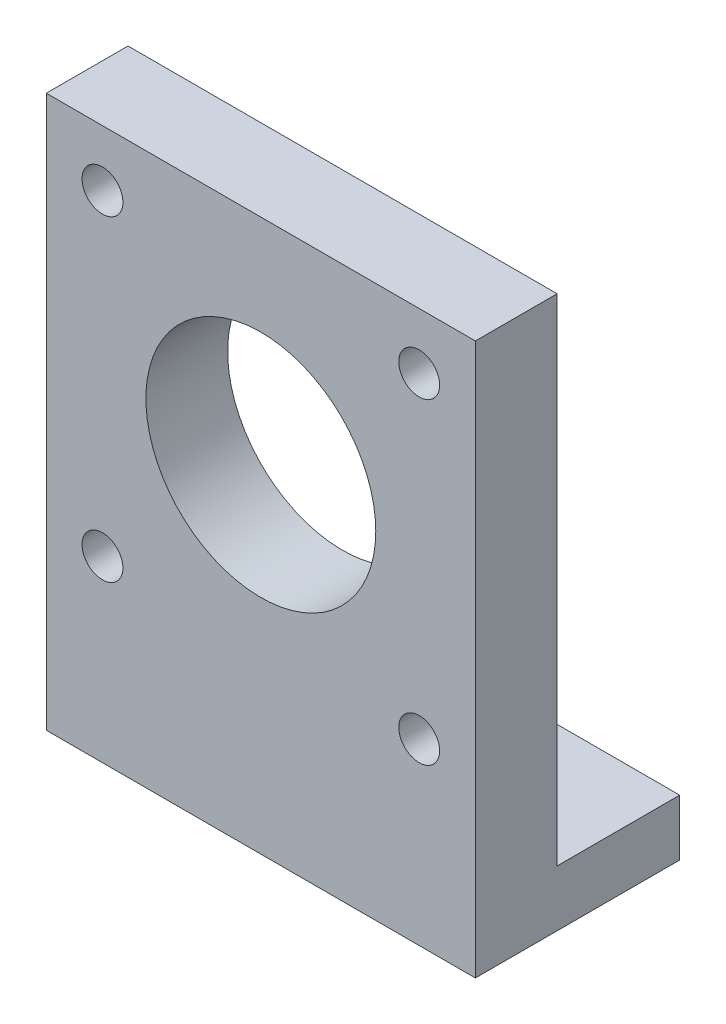
ISO-10303-21;
HEADER;
FILE_DESCRIPTION(('STEP AP214'),'2;1');
FILE_NAME('part.step','',(''),(''),'','','');
FILE_SCHEMA(('AUTOMOTIVE_DESIGN { 1 0 10303 214 1 1 1 1 }'));
ENDSEC;
DATA;
#1=APPLICATION_CONTEXT('core data for automotive mechanical design processes');
#2=APPLICATION_PROTOCOL_DEFINITION('international standard','automotive_design',2000,#1);
#3=PRODUCT_CONTEXT('',#1,'mechanical');
#4=PRODUCT('Part','Part','',(#3));
#5=PRODUCT_RELATED_PRODUCT_CATEGORY('part','',(#4));
#6=PRODUCT_DEFINITION_FORMATION('','',#4);
#7=PRODUCT_DEFINITION_CONTEXT('part definition',#1,'design');
#8=PRODUCT_DEFINITION('design','',#6,#7);
#9=PRODUCT_DEFINITION_SHAPE('','',#8);
#10=(LENGTH_UNIT() NAMED_UNIT(*) SI_UNIT(.MILLI.,.METRE.));
#11=(NAMED_UNIT(*) PLANE_ANGLE_UNIT() SI_UNIT($,.RADIAN.));
#12=(NAMED_UNIT(*) SI_UNIT($,.STERADIAN.) SOLID_ANGLE_UNIT());
#13=UNCERTAINTY_MEASURE_WITH_UNIT(LENGTH_MEASURE(1.E-05),#10,'distance_accuracy_value','');
#14=(GEOMETRIC_REPRESENTATION_CONTEXT(3) GLOBAL_UNCERTAINTY_ASSIGNED_CONTEXT((#13)) GLOBAL_UNIT_ASSIGNED_CONTEXT((#10,
#11,#12)) REPRESENTATION_CONTEXT('',''));
#15=CARTESIAN_POINT('',(0.,0.,0.));
#16=DIRECTION('',(0.,0.,1.));
#17=DIRECTION('',(1.,0.,0.));
#18=AXIS2_PLACEMENT_3D('',#15,#16,#17);
#19=CARTESIAN_POINT('',(0.,0.,0.));
#20=DIRECTION('',(0.,0.,1.));
#21=DIRECTION('',(1.,0.,0.));
#22=AXIS2_PLACEMENT_3D('',#19,#20,#21);
#23=PLANE('',#22);
#24=CARTESIAN_POINT('',(0.,0.,0.));
#25=DIRECTION('',(0.,0.,1.));
#26=DIRECTION('',(1.,0.,0.));
#27=AXIS2_PLACEMENT_3D('',#24,#25,#26);
#28=CIRCLE('',#27,11.25);
#29=CARTESIAN_POINT('',(11.25,0.,0.));
#30=VERTEX_POINT('',#29);
#31=EDGE_CURVE('E125',#30,#30,#28,.T.);
#32=ORIENTED_EDGE('',*,*,#31,.T.);
#33=EDGE_LOOP('',(#32));
#34=FACE_BOUND('',#33,.T.);
#35=CARTESIAN_POINT('',(15.5,-15.5,0.));
#36=DIRECTION('',(0.,0.,1.));
#37=DIRECTION('',(1.,0.,0.));
#38=AXIS2_PLACEMENT_3D('',#35,#36,#37);
#39=CIRCLE('',#38,2.);
#40=CARTESIAN_POINT('',(17.5,-15.5,0.));
#41=VERTEX_POINT('',#40);
#42=EDGE_CURVE('E113',#41,#41,#39,.T.);
#43=ORIENTED_EDGE('',*,*,#42,.T.);
#44=EDGE_LOOP('',(#43));
#45=FACE_BOUND('',#44,.T.);
#46=CARTESIAN_POINT('',(-15.5,15.5,0.));
#47=DIRECTION('',(0.,0.,1.));
#48=DIRECTION('',(1.,0.,0.));
#49=AXIS2_PLACEMENT_3D('',#46,#47,#48);
#50=CIRCLE('',#49,2.);
#51=CARTESIAN_POINT('',(-13.5,15.5,0.));
#52=VERTEX_POINT('',#51);
#53=EDGE_CURVE('E100',#52,#52,#50,.T.);
#54=ORIENTED_EDGE('',*,*,#53,.T.);
#55=EDGE_LOOP('',(#54));
#56=FACE_BOUND('',#55,.T.);
#57=CARTESIAN_POINT('',(15.5,15.5,0.));
#58=DIRECTION('',(0.,0.,1.));
#59=DIRECTION('',(1.,0.,0.));
#60=AXIS2_PLACEMENT_3D('',#57,#58,#59);
#61=CIRCLE('',#60,2.);
#62=CARTESIAN_POINT('',(17.5,15.5,0.));
#63=VERTEX_POINT('',#62);
#64=EDGE_CURVE('E107',#63,#63,#61,.T.);
#65=ORIENTED_EDGE('',*,*,#64,.T.);
#66=EDGE_LOOP('',(#65));
#67=FACE_BOUND('',#66,.T.);
#68=CARTESIAN_POINT('',(-15.5,-15.5,0.));
#69=DIRECTION('',(0.,0.,1.));
#70=DIRECTION('',(1.,0.,0.));
#71=AXIS2_PLACEMENT_3D('',#68,#69,#70);
#72=CIRCLE('',#71,2.);
#73=CARTESIAN_POINT('',(-13.5,-15.5,0.));
#74=VERTEX_POINT('',#73);
#75=EDGE_CURVE('E119',#74,#74,#72,.T.);
#76=ORIENTED_EDGE('',*,*,#75,.T.);
#77=EDGE_LOOP('',(#76));
#78=FACE_BOUND('',#77,.T.);
#79=DIRECTION('',(1.,0.,0.));
#80=VECTOR('',#79,1.);
#81=CARTESIAN_POINT('',(21.,-27.5,0.));
#82=LINE('',#81,#80);
#83=CARTESIAN_POINT('',(-21.,-27.5,0.));
#84=VERTEX_POINT('',#83);
#85=CARTESIAN_POINT('',(21.,-27.5,0.));
#86=VERTEX_POINT('',#85);
#87=EDGE_CURVE('E50',#84,#86,#82,.T.);
#88=ORIENTED_EDGE('',*,*,#87,.F.);
#89=DIRECTION('',(0.,-1.,0.));
#90=VECTOR('',#89,1.);
#91=CARTESIAN_POINT('',(-21.,21.,0.));
#92=LINE('',#91,#90);
#93=CARTESIAN_POINT('',(-21.,21.,0.));
#94=VERTEX_POINT('',#93);
#95=EDGE_CURVE('E76',#94,#84,#92,.T.);
#96=ORIENTED_EDGE('',*,*,#95,.F.);
#97=DIRECTION('',(-1.,0.,0.));
#98=VECTOR('',#97,1.);
#99=CARTESIAN_POINT('',(-21.,21.,0.));
#100=LINE('',#99,#98);
#101=CARTESIAN_POINT('',(21.,21.,0.));
#102=VERTEX_POINT('',#101);
#103=EDGE_CURVE('E71',#102,#94,#100,.T.);
#104=ORIENTED_EDGE('',*,*,#103,.F.);
#105=DIRECTION('',(0.,1.,0.));
#106=VECTOR('',#105,1.);
#107=CARTESIAN_POINT('',(21.,21.,0.));
#108=LINE('',#107,#106);
#109=EDGE_CURVE('E77',#86,#102,#108,.T.);
#110=ORIENTED_EDGE('',*,*,#109,.F.);
#111=EDGE_LOOP('',(#88,#96,#104,#110));
#112=FACE_BOUND('',#111,.T.);
#113=ADVANCED_FACE('F33',(#34,#45,#56,#67,#78,#112),#23,.F.);
#114=CARTESIAN_POINT('',(0.,0.,8.));
#115=DIRECTION('',(0.,0.,1.));
#116=DIRECTION('',(1.,0.,0.));
#117=AXIS2_PLACEMENT_3D('',#114,#115,#116);
#118=PLANE('',#117);
#119=CARTESIAN_POINT('',(-15.5,-15.5,8.));
#120=DIRECTION('',(0.,0.,1.));
#121=DIRECTION('',(1.,0.,0.));
#122=AXIS2_PLACEMENT_3D('',#119,#120,#121);
#123=CIRCLE('',#122,2.);
#124=CARTESIAN_POINT('',(-13.5,-15.5,8.));
#125=VERTEX_POINT('',#124);
#126=EDGE_CURVE('E116',#125,#125,#123,.T.);
#127=ORIENTED_EDGE('',*,*,#126,.F.);
#128=EDGE_LOOP('',(#127));
#129=FACE_BOUND('',#128,.T.);
#130=CARTESIAN_POINT('',(15.5,15.5,8.));
#131=DIRECTION('',(0.,0.,1.));
#132=DIRECTION('',(1.,0.,0.));
#133=AXIS2_PLACEMENT_3D('',#130,#131,#132);
#134=CIRCLE('',#133,2.);
#135=CARTESIAN_POINT('',(17.5,15.5,8.));
#136=VERTEX_POINT('',#135);
#137=EDGE_CURVE('E104',#136,#136,#134,.T.);
#138=ORIENTED_EDGE('',*,*,#137,.F.);
#139=EDGE_LOOP('',(#138));
#140=FACE_BOUND('',#139,.T.);
#141=DIRECTION('',(0.,1.,0.));
#142=VECTOR('',#141,1.);
#143=CARTESIAN_POINT('',(21.,21.,8.));
#144=LINE('',#143,#142);
#145=CARTESIAN_POINT('',(21.,-33.,8.));
#146=VERTEX_POINT('',#145);
#147=CARTESIAN_POINT('',(21.,21.,8.));
#148=VERTEX_POINT('',#147);
#149=EDGE_CURVE('E86',#146,#148,#144,.T.);
#150=ORIENTED_EDGE('',*,*,#149,.T.);
#151=DIRECTION('',(-1.,0.,0.));
#152=VECTOR('',#151,1.);
#153=CARTESIAN_POINT('',(-21.,21.,8.));
#154=LINE('',#153,#152);
#155=CARTESIAN_POINT('',(-21.,21.,8.));
#156=VERTEX_POINT('',#155);
#157=EDGE_CURVE('E59',#148,#156,#154,.T.);
#158=ORIENTED_EDGE('',*,*,#157,.T.);
#159=DIRECTION('',(0.,-1.,0.));
#160=VECTOR('',#159,1.);
#161=CARTESIAN_POINT('',(-21.,21.,8.));
#162=LINE('',#161,#160);
#163=CARTESIAN_POINT('',(-21.,-33.,8.));
#164=VERTEX_POINT('',#163);
#165=EDGE_CURVE('E84',#156,#164,#162,.T.);
#166=ORIENTED_EDGE('',*,*,#165,.T.);
#167=DIRECTION('',(1.,0.,0.));
#168=VECTOR('',#167,1.);
#169=CARTESIAN_POINT('',(-21.,-33.,8.));
#170=LINE('',#169,#168);
#171=EDGE_CURVE('E133',#164,#146,#170,.T.);
#172=ORIENTED_EDGE('',*,*,#171,.T.);
#173=EDGE_LOOP('',(#150,#158,#166,#172));
#174=FACE_BOUND('',#173,.T.);
#175=CARTESIAN_POINT('',(-15.5,15.5,8.));
#176=DIRECTION('',(0.,0.,1.));
#177=DIRECTION('',(1.,0.,0.));
#178=AXIS2_PLACEMENT_3D('',#175,#176,#177);
#179=CIRCLE('',#178,2.);
#180=CARTESIAN_POINT('',(-13.5,15.5,8.));
#181=VERTEX_POINT('',#180);
#182=EDGE_CURVE('E103',#181,#181,#179,.T.);
#183=ORIENTED_EDGE('',*,*,#182,.F.);
#184=EDGE_LOOP('',(#183));
#185=FACE_BOUND('',#184,.T.);
#186=CARTESIAN_POINT('',(15.5,-15.5,8.));
#187=DIRECTION('',(0.,0.,1.));
#188=DIRECTION('',(1.,0.,0.));
#189=AXIS2_PLACEMENT_3D('',#186,#187,#188);
#190=CIRCLE('',#189,2.);
#191=CARTESIAN_POINT('',(17.5,-15.5,8.));
#192=VERTEX_POINT('',#191);
#193=EDGE_CURVE('E110',#192,#192,#190,.T.);
#194=ORIENTED_EDGE('',*,*,#193,.F.);
#195=EDGE_LOOP('',(#194));
#196=FACE_BOUND('',#195,.T.);
#197=CARTESIAN_POINT('',(0.,0.,8.));
#198=DIRECTION('',(0.,0.,1.));
#199=DIRECTION('',(1.,0.,0.));
#200=AXIS2_PLACEMENT_3D('',#197,#198,#199);
#201=CIRCLE('',#200,11.25);
#202=CARTESIAN_POINT('',(11.25,0.,8.));
#203=VERTEX_POINT('',#202);
#204=EDGE_CURVE('E122',#203,#203,#201,.T.);
#205=ORIENTED_EDGE('',*,*,#204,.F.);
#206=EDGE_LOOP('',(#205));
#207=FACE_BOUND('',#206,.T.);
#208=ADVANCED_FACE('F183',(#129,#140,#174,#185,#196,#207),#118,.T.);
#209=CARTESIAN_POINT('',(21.,21.,8.));
#210=DIRECTION('',(-1.,0.,0.));
#211=DIRECTION('',(0.,0.,1.));
#212=AXIS2_PLACEMENT_3D('',#209,#210,#211);
#213=PLANE('',#212);
#214=DIRECTION('',(0.,0.,1.));
#215=VECTOR('',#214,1.);
#216=CARTESIAN_POINT('',(21.,-33.,0.));
#217=LINE('',#216,#215);
#218=CARTESIAN_POINT('',(21.,-33.,-12.));
#219=VERTEX_POINT('',#218);
#220=EDGE_CURVE('E128',#219,#146,#217,.T.);
#221=ORIENTED_EDGE('',*,*,#220,.F.);
#222=DIRECTION('',(0.,-1.,0.));
#223=VECTOR('',#222,1.);
#224=CARTESIAN_POINT('',(21.,-27.5,-12.));
#225=LINE('',#224,#223);
#226=CARTESIAN_POINT('',(21.,-27.5,-12.));
#227=VERTEX_POINT('',#226);
#228=EDGE_CURVE('E144',#227,#219,#225,.T.);
#229=ORIENTED_EDGE('',*,*,#228,.F.);
#230=DIRECTION('',(0.,0.,1.));
#231=VECTOR('',#230,1.);
#232=CARTESIAN_POINT('',(21.,-27.5,-12.));
#233=LINE('',#232,#231);
#234=EDGE_CURVE('E143',#227,#86,#233,.T.);
#235=ORIENTED_EDGE('',*,*,#234,.T.);
#236=ORIENTED_EDGE('',*,*,#109,.T.);
#237=DIRECTION('',(0.,0.,-1.));
#238=VECTOR('',#237,1.);
#239=CARTESIAN_POINT('',(21.,21.,8.));
#240=LINE('',#239,#238);
#241=EDGE_CURVE('E11',#148,#102,#240,.T.);
#242=ORIENTED_EDGE('',*,*,#241,.F.);
#243=ORIENTED_EDGE('',*,*,#149,.F.);
#244=EDGE_LOOP('',(#221,#229,#235,#236,#242,#243));
#245=FACE_BOUND('',#244,.T.);
#246=ADVANCED_FACE('F35',(#245),#213,.F.);
#247=CARTESIAN_POINT('',(-21.,21.,8.));
#248=DIRECTION('',(0.,-1.,0.));
#249=DIRECTION('',(0.,0.,-1.));
#250=AXIS2_PLACEMENT_3D('',#247,#248,#249);
#251=PLANE('',#250);
#252=ORIENTED_EDGE('',*,*,#103,.T.);
#253=DIRECTION('',(0.,0.,-1.));
#254=VECTOR('',#253,1.);
#255=CARTESIAN_POINT('',(-21.,21.,8.));
#256=LINE('',#255,#254);
#257=EDGE_CURVE('E42',#156,#94,#256,.T.);
#258=ORIENTED_EDGE('',*,*,#257,.F.);
#259=ORIENTED_EDGE('',*,*,#157,.F.);
#260=ORIENTED_EDGE('',*,*,#241,.T.);
#261=EDGE_LOOP('',(#252,#258,#259,#260));
#262=FACE_BOUND('',#261,.T.);
#263=ADVANCED_FACE('F73',(#262),#251,.F.);
#264=CARTESIAN_POINT('',(-21.,21.,8.));
#265=DIRECTION('',(1.,0.,0.));
#266=DIRECTION('',(0.,1.,0.));
#267=AXIS2_PLACEMENT_3D('',#264,#265,#266);
#268=PLANE('',#267);
#269=ORIENTED_EDGE('',*,*,#95,.T.);
#270=DIRECTION('',(0.,0.,1.));
#271=VECTOR('',#270,1.);
#272=CARTESIAN_POINT('',(-21.,-27.5,-12.));
#273=LINE('',#272,#271);
#274=CARTESIAN_POINT('',(-21.,-27.5,-12.));
#275=VERTEX_POINT('',#274);
#276=EDGE_CURVE('E137',#275,#84,#273,.T.);
#277=ORIENTED_EDGE('',*,*,#276,.F.);
#278=DIRECTION('',(0.,1.,0.));
#279=VECTOR('',#278,1.);
#280=CARTESIAN_POINT('',(-21.,-27.5,-12.));
#281=LINE('',#280,#279);
#282=CARTESIAN_POINT('',(-21.,-33.,-12.));
#283=VERTEX_POINT('',#282);
#284=EDGE_CURVE('E150',#283,#275,#281,.T.);
#285=ORIENTED_EDGE('',*,*,#284,.F.);
#286=DIRECTION('',(0.,0.,1.));
#287=VECTOR('',#286,1.);
#288=CARTESIAN_POINT('',(-21.,-33.,0.));
#289=LINE('',#288,#287);
#290=EDGE_CURVE('E131',#283,#164,#289,.T.);
#291=ORIENTED_EDGE('',*,*,#290,.T.);
#292=ORIENTED_EDGE('',*,*,#165,.F.);
#293=ORIENTED_EDGE('',*,*,#257,.T.);
#294=EDGE_LOOP('',(#269,#277,#285,#291,#292,#293));
#295=FACE_BOUND('',#294,.T.);
#296=ADVANCED_FACE('F80',(#295),#268,.F.);
#297=CARTESIAN_POINT('',(-15.5,15.5,8.));
#298=DIRECTION('',(0.,0.,-1.));
#299=DIRECTION('',(-1.,0.,0.));
#300=AXIS2_PLACEMENT_3D('',#297,#298,#299);
#301=CYLINDRICAL_SURFACE('',#300,2.);
#302=ORIENTED_EDGE('',*,*,#182,.T.);
#303=EDGE_LOOP('',(#302));
#304=FACE_BOUND('',#303,.T.);
#305=ORIENTED_EDGE('',*,*,#53,.F.);
#306=EDGE_LOOP('',(#305));
#307=FACE_BOUND('',#306,.T.);
#308=ADVANCED_FACE('F226',(#304,#307),#301,.F.);
#309=CARTESIAN_POINT('',(15.5,15.5,8.));
#310=DIRECTION('',(0.,0.,-1.));
#311=DIRECTION('',(-1.,0.,0.));
#312=AXIS2_PLACEMENT_3D('',#309,#310,#311);
#313=CYLINDRICAL_SURFACE('',#312,2.);
#314=ORIENTED_EDGE('',*,*,#137,.T.);
#315=EDGE_LOOP('',(#314));
#316=FACE_BOUND('',#315,.T.);
#317=ORIENTED_EDGE('',*,*,#64,.F.);
#318=EDGE_LOOP('',(#317));
#319=FACE_BOUND('',#318,.T.);
#320=ADVANCED_FACE('F219',(#316,#319),#313,.F.);
#321=CARTESIAN_POINT('',(15.5,-15.5,8.));
#322=DIRECTION('',(0.,0.,-1.));
#323=DIRECTION('',(-1.,0.,0.));
#324=AXIS2_PLACEMENT_3D('',#321,#322,#323);
#325=CYLINDRICAL_SURFACE('',#324,2.);
#326=ORIENTED_EDGE('',*,*,#193,.T.);
#327=EDGE_LOOP('',(#326));
#328=FACE_BOUND('',#327,.T.);
#329=ORIENTED_EDGE('',*,*,#42,.F.);
#330=EDGE_LOOP('',(#329));
#331=FACE_BOUND('',#330,.T.);
#332=ADVANCED_FACE('F213',(#328,#331),#325,.F.);
#333=CARTESIAN_POINT('',(-15.5,-15.5,8.));
#334=DIRECTION('',(0.,0.,-1.));
#335=DIRECTION('',(-1.,0.,0.));
#336=AXIS2_PLACEMENT_3D('',#333,#334,#335);
#337=CYLINDRICAL_SURFACE('',#336,2.);
#338=ORIENTED_EDGE('',*,*,#126,.T.);
#339=EDGE_LOOP('',(#338));
#340=FACE_BOUND('',#339,.T.);
#341=ORIENTED_EDGE('',*,*,#75,.F.);
#342=EDGE_LOOP('',(#341));
#343=FACE_BOUND('',#342,.T.);
#344=ADVANCED_FACE('F197',(#340,#343),#337,.F.);
#345=CARTESIAN_POINT('',(0.,0.,8.));
#346=DIRECTION('',(0.,0.,-1.));
#347=DIRECTION('',(-1.,0.,0.));
#348=AXIS2_PLACEMENT_3D('',#345,#346,#347);
#349=CYLINDRICAL_SURFACE('',#348,11.25);
#350=ORIENTED_EDGE('',*,*,#204,.T.);
#351=EDGE_LOOP('',(#350));
#352=FACE_BOUND('',#351,.T.);
#353=ORIENTED_EDGE('',*,*,#31,.F.);
#354=EDGE_LOOP('',(#353));
#355=FACE_BOUND('',#354,.T.);
#356=ADVANCED_FACE('F194',(#352,#355),#349,.F.);
#357=CARTESIAN_POINT('',(-21.,-33.,0.));
#358=DIRECTION('',(0.,-1.,0.));
#359=DIRECTION('',(0.,0.,-1.));
#360=AXIS2_PLACEMENT_3D('',#357,#358,#359);
#361=PLANE('',#360);
#362=ORIENTED_EDGE('',*,*,#171,.F.);
#363=ORIENTED_EDGE('',*,*,#290,.F.);
#364=DIRECTION('',(-1.,0.,0.));
#365=VECTOR('',#364,1.);
#366=CARTESIAN_POINT('',(21.,-33.,-12.));
#367=LINE('',#366,#365);
#368=EDGE_CURVE('E140',#219,#283,#367,.T.);
#369=ORIENTED_EDGE('',*,*,#368,.F.);
#370=ORIENTED_EDGE('',*,*,#220,.T.);
#371=EDGE_LOOP('',(#362,#363,#369,#370));
#372=FACE_BOUND('',#371,.T.);
#373=ADVANCED_FACE('F178',(#372),#361,.T.);
#374=CARTESIAN_POINT('',(21.,-27.5,-12.));
#375=DIRECTION('',(0.,-1.,0.));
#376=DIRECTION('',(0.,0.,-1.));
#377=AXIS2_PLACEMENT_3D('',#374,#375,#376);
#378=PLANE('',#377);
#379=ORIENTED_EDGE('',*,*,#87,.T.);
#380=ORIENTED_EDGE('',*,*,#234,.F.);
#381=DIRECTION('',(1.,0.,0.));
#382=VECTOR('',#381,1.);
#383=CARTESIAN_POINT('',(21.,-27.5,-12.));
#384=LINE('',#383,#382);
#385=EDGE_CURVE('E147',#275,#227,#384,.T.);
#386=ORIENTED_EDGE('',*,*,#385,.F.);
#387=ORIENTED_EDGE('',*,*,#276,.T.);
#388=EDGE_LOOP('',(#379,#380,#386,#387));
#389=FACE_BOUND('',#388,.T.);
#390=ADVANCED_FACE('F159',(#389),#378,.F.);
#391=CARTESIAN_POINT('',(0.,0.,-12.));
#392=DIRECTION('',(0.,0.,-1.));
#393=DIRECTION('',(-1.,0.,0.));
#394=AXIS2_PLACEMENT_3D('',#391,#392,#393);
#395=PLANE('',#394);
#396=ORIENTED_EDGE('',*,*,#284,.T.);
#397=ORIENTED_EDGE('',*,*,#385,.T.);
#398=ORIENTED_EDGE('',*,*,#228,.T.);
#399=ORIENTED_EDGE('',*,*,#368,.T.);
#400=EDGE_LOOP('',(#396,#397,#398,#399));
#401=FACE_BOUND('',#400,.T.);
#402=ADVANCED_FACE('F172',(#401),#395,.T.);
#403=CLOSED_SHELL('',(#113,#208,#246,#263,#296,#308,#320,#332,#344,#356,#373,#390,#402));
#404=MANIFOLD_SOLID_BREP('B2',#403);
#405=ADVANCED_BREP_SHAPE_REPRESENTATION('',(#18,#404),#14);
#406=SHAPE_DEFINITION_REPRESENTATION(#9,#405);
ENDSEC;
END-ISO-10303-21;
